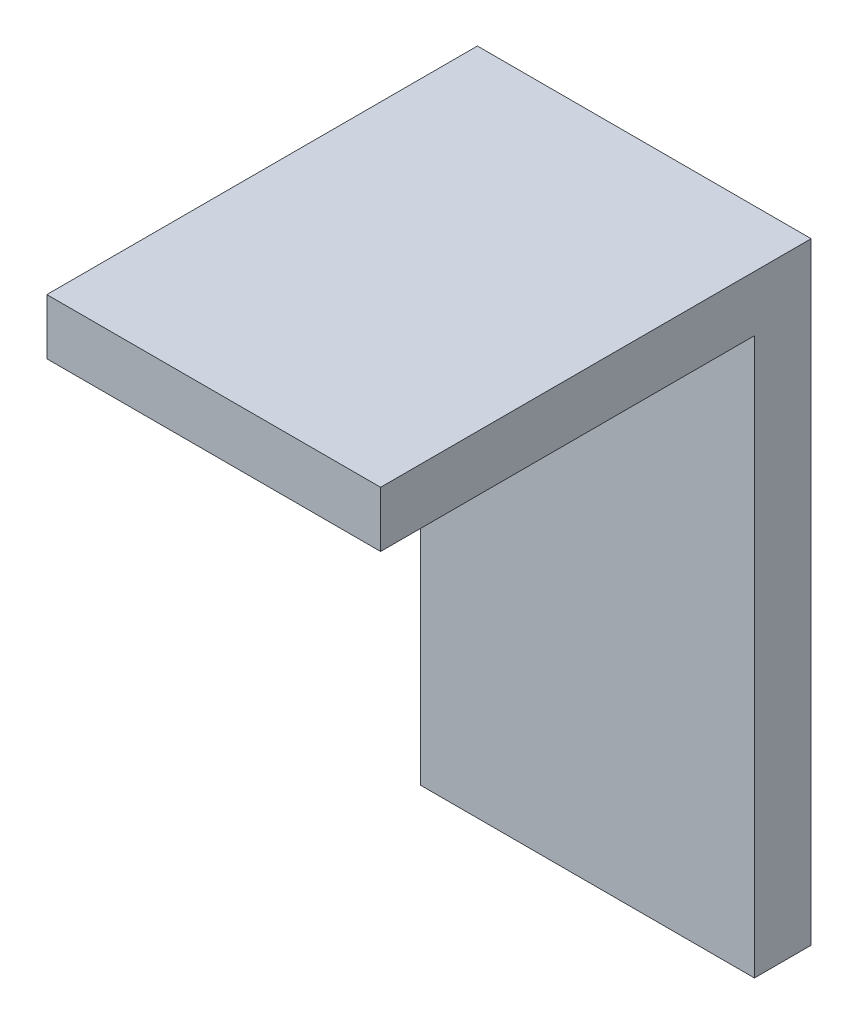
ISO-10303-21;
HEADER;
FILE_DESCRIPTION(('STEP AP214'),'2;1');
FILE_NAME('part.step','',(''),(''),'','','');
FILE_SCHEMA(('AUTOMOTIVE_DESIGN { 1 0 10303 214 1 1 1 1 }'));
ENDSEC;
DATA;
#1=APPLICATION_CONTEXT('core data for automotive mechanical design processes');
#2=APPLICATION_PROTOCOL_DEFINITION('international standard','automotive_design',2000,#1);
#3=PRODUCT_CONTEXT('',#1,'mechanical');
#4=PRODUCT('Part','Part','',(#3));
#5=PRODUCT_RELATED_PRODUCT_CATEGORY('part','',(#4));
#6=PRODUCT_DEFINITION_FORMATION('','',#4);
#7=PRODUCT_DEFINITION_CONTEXT('part definition',#1,'design');
#8=PRODUCT_DEFINITION('design','',#6,#7);
#9=PRODUCT_DEFINITION_SHAPE('','',#8);
#10=(LENGTH_UNIT() NAMED_UNIT(*) SI_UNIT(.MILLI.,.METRE.));
#11=(NAMED_UNIT(*) PLANE_ANGLE_UNIT() SI_UNIT($,.RADIAN.));
#12=(NAMED_UNIT(*) SI_UNIT($,.STERADIAN.) SOLID_ANGLE_UNIT());
#13=UNCERTAINTY_MEASURE_WITH_UNIT(LENGTH_MEASURE(1.E-05),#10,'distance_accuracy_value','');
#14=(GEOMETRIC_REPRESENTATION_CONTEXT(3) GLOBAL_UNCERTAINTY_ASSIGNED_CONTEXT((#13)) GLOBAL_UNIT_ASSIGNED_CONTEXT((#10,
#11,#12)) REPRESENTATION_CONTEXT('',''));
#15=CARTESIAN_POINT('',(0.,0.,0.));
#16=DIRECTION('',(0.,0.,1.));
#17=DIRECTION('',(1.,0.,0.));
#18=AXIS2_PLACEMENT_3D('',#15,#16,#17);
#19=CARTESIAN_POINT('',(0.1,4.55,0.));
#20=DIRECTION('',(-1.,0.,0.));
#21=DIRECTION('',(0.,0.,1.));
#22=AXIS2_PLACEMENT_3D('',#19,#20,#21);
#23=PLANE('',#22);
#24=DIRECTION('',(0.,1.,0.));
#25=VECTOR('',#24,1.);
#26=CARTESIAN_POINT('',(0.1,4.,0.));
#27=LINE('',#26,#25);
#28=CARTESIAN_POINT('',(0.1,4.,0.));
#29=VERTEX_POINT('',#28);
#30=CARTESIAN_POINT('',(0.1,4.55,0.));
#31=VERTEX_POINT('',#30);
#32=EDGE_CURVE('E11',#29,#31,#27,.T.);
#33=ORIENTED_EDGE('',*,*,#32,.F.);
#34=DIRECTION('',(0.,0.,-1.));
#35=VECTOR('',#34,1.);
#36=CARTESIAN_POINT('',(0.1,4.,0.051));
#37=LINE('',#36,#35);
#38=CARTESIAN_POINT('',(0.1,4.,0.051));
#39=VERTEX_POINT('',#38);
#40=EDGE_CURVE('E24',#39,#29,#37,.T.);
#41=ORIENTED_EDGE('',*,*,#40,.F.);
#42=DIRECTION('',(0.,-1.,0.));
#43=VECTOR('',#42,1.);
#44=CARTESIAN_POINT('',(0.1,4.5,0.051));
#45=LINE('',#44,#43);
#46=CARTESIAN_POINT('',(0.1,4.5,0.051));
#47=VERTEX_POINT('',#46);
#48=EDGE_CURVE('E87',#47,#39,#45,.T.);
#49=ORIENTED_EDGE('',*,*,#48,.F.);
#50=DIRECTION('',(0.,0.,-1.));
#51=VECTOR('',#50,1.);
#52=CARTESIAN_POINT('',(0.1,4.5,0.387));
#53=LINE('',#52,#51);
#54=CARTESIAN_POINT('',(0.1,4.5,0.387));
#55=VERTEX_POINT('',#54);
#56=EDGE_CURVE('E114',#55,#47,#53,.T.);
#57=ORIENTED_EDGE('',*,*,#56,.F.);
#58=DIRECTION('',(0.,-1.,0.));
#59=VECTOR('',#58,1.);
#60=CARTESIAN_POINT('',(0.1,4.55,0.387));
#61=LINE('',#60,#59);
#62=CARTESIAN_POINT('',(0.1,4.55,0.387));
#63=VERTEX_POINT('',#62);
#64=EDGE_CURVE('E111',#63,#55,#61,.T.);
#65=ORIENTED_EDGE('',*,*,#64,.F.);
#66=DIRECTION('',(0.,0.,1.));
#67=VECTOR('',#66,1.);
#68=CARTESIAN_POINT('',(0.1,4.55,0.));
#69=LINE('',#68,#67);
#70=EDGE_CURVE('E108',#31,#63,#69,.T.);
#71=ORIENTED_EDGE('',*,*,#70,.F.);
#72=EDGE_LOOP('',(#33,#41,#49,#57,#65,#71));
#73=FACE_BOUND('',#72,.T.);
#74=ADVANCED_FACE('F17',(#73),#23,.T.);
#75=CARTESIAN_POINT('',(0.4,4.,0.));
#76=DIRECTION('',(1.,0.,0.));
#77=DIRECTION('',(0.,0.,1.));
#78=AXIS2_PLACEMENT_3D('',#75,#76,#77);
#79=PLANE('',#78);
#80=DIRECTION('',(0.,-1.,0.));
#81=VECTOR('',#80,1.);
#82=CARTESIAN_POINT('',(0.4,4.55,0.));
#83=LINE('',#82,#81);
#84=CARTESIAN_POINT('',(0.4,4.55,0.));
#85=VERTEX_POINT('',#84);
#86=CARTESIAN_POINT('',(0.4,4.,0.));
#87=VERTEX_POINT('',#86);
#88=EDGE_CURVE('E106',#85,#87,#83,.T.);
#89=ORIENTED_EDGE('',*,*,#88,.F.);
#90=DIRECTION('',(0.,0.,-1.));
#91=VECTOR('',#90,1.);
#92=CARTESIAN_POINT('',(0.4,4.55,0.387));
#93=LINE('',#92,#91);
#94=CARTESIAN_POINT('',(0.4,4.55,0.387));
#95=VERTEX_POINT('',#94);
#96=EDGE_CURVE('E103',#95,#85,#93,.T.);
#97=ORIENTED_EDGE('',*,*,#96,.F.);
#98=DIRECTION('',(0.,1.,0.));
#99=VECTOR('',#98,1.);
#100=CARTESIAN_POINT('',(0.4,4.5,0.387));
#101=LINE('',#100,#99);
#102=CARTESIAN_POINT('',(0.4,4.5,0.387));
#103=VERTEX_POINT('',#102);
#104=EDGE_CURVE('E100',#103,#95,#101,.T.);
#105=ORIENTED_EDGE('',*,*,#104,.F.);
#106=DIRECTION('',(0.,0.,1.));
#107=VECTOR('',#106,1.);
#108=CARTESIAN_POINT('',(0.4,4.5,0.051));
#109=LINE('',#108,#107);
#110=CARTESIAN_POINT('',(0.4,4.5,0.051));
#111=VERTEX_POINT('',#110);
#112=EDGE_CURVE('E72',#111,#103,#109,.T.);
#113=ORIENTED_EDGE('',*,*,#112,.F.);
#114=DIRECTION('',(0.,1.,0.));
#115=VECTOR('',#114,1.);
#116=CARTESIAN_POINT('',(0.4,4.,0.051));
#117=LINE('',#116,#115);
#118=CARTESIAN_POINT('',(0.4,4.,0.051));
#119=VERTEX_POINT('',#118);
#120=EDGE_CURVE('E66',#119,#111,#117,.T.);
#121=ORIENTED_EDGE('',*,*,#120,.F.);
#122=DIRECTION('',(0.,0.,1.));
#123=VECTOR('',#122,1.);
#124=CARTESIAN_POINT('',(0.4,4.,0.));
#125=LINE('',#124,#123);
#126=EDGE_CURVE('E69',#87,#119,#125,.T.);
#127=ORIENTED_EDGE('',*,*,#126,.F.);
#128=EDGE_LOOP('',(#89,#97,#105,#113,#121,#127));
#129=FACE_BOUND('',#128,.T.);
#130=ADVANCED_FACE('F68',(#129),#79,.T.);
#131=CARTESIAN_POINT('',(0.1,4.55,0.387));
#132=DIRECTION('',(0.,0.,1.));
#133=DIRECTION('',(0.,1.,0.));
#134=AXIS2_PLACEMENT_3D('',#131,#132,#133);
#135=PLANE('',#134);
#136=ORIENTED_EDGE('',*,*,#64,.T.);
#137=DIRECTION('',(-1.,0.,0.));
#138=VECTOR('',#137,1.);
#139=CARTESIAN_POINT('',(0.4,4.5,0.387));
#140=LINE('',#139,#138);
#141=EDGE_CURVE('E83',#103,#55,#140,.T.);
#142=ORIENTED_EDGE('',*,*,#141,.F.);
#143=ORIENTED_EDGE('',*,*,#104,.T.);
#144=DIRECTION('',(1.,0.,0.));
#145=VECTOR('',#144,1.);
#146=CARTESIAN_POINT('',(0.1,4.55,0.387));
#147=LINE('',#146,#145);
#148=EDGE_CURVE('E88',#63,#95,#147,.T.);
#149=ORIENTED_EDGE('',*,*,#148,.F.);
#150=EDGE_LOOP('',(#136,#142,#143,#149));
#151=FACE_BOUND('',#150,.T.);
#152=ADVANCED_FACE('F125',(#151),#135,.T.);
#153=CARTESIAN_POINT('',(0.1,4.5,0.051));
#154=DIRECTION('',(0.,0.,1.));
#155=DIRECTION('',(0.,1.,0.));
#156=AXIS2_PLACEMENT_3D('',#153,#154,#155);
#157=PLANE('',#156);
#158=ORIENTED_EDGE('',*,*,#48,.T.);
#159=DIRECTION('',(-1.,0.,0.));
#160=VECTOR('',#159,1.);
#161=CARTESIAN_POINT('',(0.4,4.,0.051));
#162=LINE('',#161,#160);
#163=EDGE_CURVE('E81',#119,#39,#162,.T.);
#164=ORIENTED_EDGE('',*,*,#163,.F.);
#165=ORIENTED_EDGE('',*,*,#120,.T.);
#166=DIRECTION('',(1.,0.,0.));
#167=VECTOR('',#166,1.);
#168=CARTESIAN_POINT('',(0.1,4.5,0.051));
#169=LINE('',#168,#167);
#170=EDGE_CURVE('E89',#47,#111,#169,.T.);
#171=ORIENTED_EDGE('',*,*,#170,.F.);
#172=EDGE_LOOP('',(#158,#164,#165,#171));
#173=FACE_BOUND('',#172,.T.);
#174=ADVANCED_FACE('F86',(#173),#157,.T.);
#175=CARTESIAN_POINT('',(0.4,4.55,0.));
#176=DIRECTION('',(0.,1.,0.));
#177=DIRECTION('',(0.,0.,1.));
#178=AXIS2_PLACEMENT_3D('',#175,#176,#177);
#179=PLANE('',#178);
#180=DIRECTION('',(1.,0.,0.));
#181=VECTOR('',#180,1.);
#182=CARTESIAN_POINT('',(0.1,4.55,0.));
#183=LINE('',#182,#181);
#184=EDGE_CURVE('E93',#31,#85,#183,.T.);
#185=ORIENTED_EDGE('',*,*,#184,.F.);
#186=ORIENTED_EDGE('',*,*,#70,.T.);
#187=ORIENTED_EDGE('',*,*,#148,.T.);
#188=ORIENTED_EDGE('',*,*,#96,.T.);
#189=EDGE_LOOP('',(#185,#186,#187,#188));
#190=FACE_BOUND('',#189,.T.);
#191=ADVANCED_FACE('F121',(#190),#179,.T.);
#192=CARTESIAN_POINT('',(0.1,4.,0.));
#193=DIRECTION('',(0.,-1.,0.));
#194=DIRECTION('',(0.,0.,1.));
#195=AXIS2_PLACEMENT_3D('',#192,#193,#194);
#196=PLANE('',#195);
#197=DIRECTION('',(-1.,0.,0.));
#198=VECTOR('',#197,1.);
#199=CARTESIAN_POINT('',(0.4,4.,0.));
#200=LINE('',#199,#198);
#201=EDGE_CURVE('E82',#87,#29,#200,.T.);
#202=ORIENTED_EDGE('',*,*,#201,.F.);
#203=ORIENTED_EDGE('',*,*,#126,.T.);
#204=ORIENTED_EDGE('',*,*,#163,.T.);
#205=ORIENTED_EDGE('',*,*,#40,.T.);
#206=EDGE_LOOP('',(#202,#203,#204,#205));
#207=FACE_BOUND('',#206,.T.);
#208=ADVANCED_FACE('F80',(#207),#196,.T.);
#209=CARTESIAN_POINT('',(0.1,4.5,0.051));
#210=DIRECTION('',(0.,-1.,0.));
#211=DIRECTION('',(0.,0.,1.));
#212=AXIS2_PLACEMENT_3D('',#209,#210,#211);
#213=PLANE('',#212);
#214=ORIENTED_EDGE('',*,*,#170,.T.);
#215=ORIENTED_EDGE('',*,*,#112,.T.);
#216=ORIENTED_EDGE('',*,*,#141,.T.);
#217=ORIENTED_EDGE('',*,*,#56,.T.);
#218=EDGE_LOOP('',(#214,#215,#216,#217));
#219=FACE_BOUND('',#218,.T.);
#220=ADVANCED_FACE('F127',(#219),#213,.T.);
#221=CARTESIAN_POINT('',(0.4,4.55,0.));
#222=DIRECTION('',(0.,0.,-1.));
#223=DIRECTION('',(0.,1.,0.));
#224=AXIS2_PLACEMENT_3D('',#221,#222,#223);
#225=PLANE('',#224);
#226=ORIENTED_EDGE('',*,*,#88,.T.);
#227=ORIENTED_EDGE('',*,*,#201,.T.);
#228=ORIENTED_EDGE('',*,*,#32,.T.);
#229=ORIENTED_EDGE('',*,*,#184,.T.);
#230=EDGE_LOOP('',(#226,#227,#228,#229));
#231=FACE_BOUND('',#230,.T.);
#232=ADVANCED_FACE('F117',(#231),#225,.T.);
#233=CLOSED_SHELL('',(#74,#130,#152,#174,#191,#208,#220,#232));
#234=MANIFOLD_SOLID_BREP('B1',#233);
#235=ADVANCED_BREP_SHAPE_REPRESENTATION('',(#18,#234),#14);
#236=SHAPE_DEFINITION_REPRESENTATION(#9,#235);
ENDSEC;
END-ISO-10303-21;
